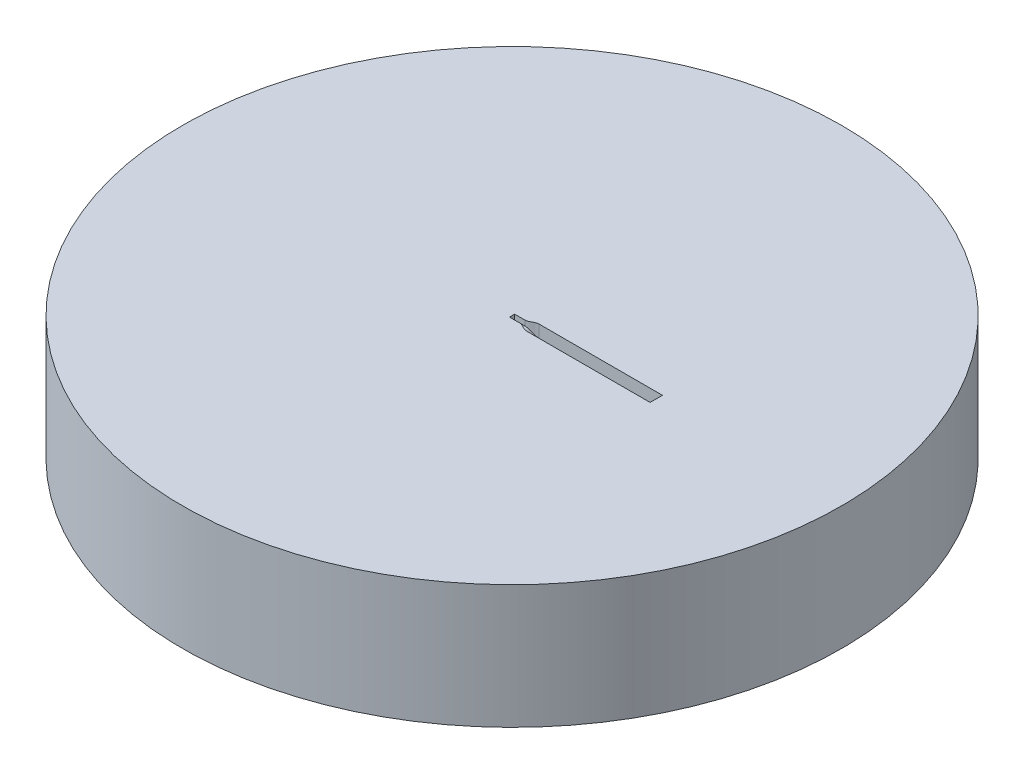
ISO-10303-21;
HEADER;
FILE_DESCRIPTION(('STEP AP214'),'2;1');
FILE_NAME('part.step','',(''),(''),'','','');
FILE_SCHEMA(('AUTOMOTIVE_DESIGN { 1 0 10303 214 1 1 1 1 }'));
ENDSEC;
DATA;
#1=APPLICATION_CONTEXT('core data for automotive mechanical design processes');
#2=APPLICATION_PROTOCOL_DEFINITION('international standard','automotive_design',2000,#1);
#3=PRODUCT_CONTEXT('',#1,'mechanical');
#4=PRODUCT('Part','Part','',(#3));
#5=PRODUCT_RELATED_PRODUCT_CATEGORY('part','',(#4));
#6=PRODUCT_DEFINITION_FORMATION('','',#4);
#7=PRODUCT_DEFINITION_CONTEXT('part definition',#1,'design');
#8=PRODUCT_DEFINITION('design','',#6,#7);
#9=PRODUCT_DEFINITION_SHAPE('','',#8);
#10=(LENGTH_UNIT() NAMED_UNIT(*) SI_UNIT(.MILLI.,.METRE.));
#11=(NAMED_UNIT(*) PLANE_ANGLE_UNIT() SI_UNIT($,.RADIAN.));
#12=(NAMED_UNIT(*) SI_UNIT($,.STERADIAN.) SOLID_ANGLE_UNIT());
#13=UNCERTAINTY_MEASURE_WITH_UNIT(LENGTH_MEASURE(1.E-05),#10,'distance_accuracy_value','');
#14=(GEOMETRIC_REPRESENTATION_CONTEXT(3) GLOBAL_UNCERTAINTY_ASSIGNED_CONTEXT((#13)) GLOBAL_UNIT_ASSIGNED_CONTEXT((#10,
#11,#12)) REPRESENTATION_CONTEXT('',''));
#15=CARTESIAN_POINT('',(0.,0.,0.));
#16=DIRECTION('',(0.,0.,1.));
#17=DIRECTION('',(1.,0.,0.));
#18=AXIS2_PLACEMENT_3D('',#15,#16,#17);
#19=CARTESIAN_POINT('',(0.,0.,0.));
#20=DIRECTION('',(0.,-1.,0.));
#21=DIRECTION('',(0.,0.,-1.));
#22=AXIS2_PLACEMENT_3D('',#19,#20,#21);
#23=PLANE('',#22);
#24=CARTESIAN_POINT('',(0.,0.,0.));
#25=DIRECTION('',(0.,-1.,0.));
#26=DIRECTION('',(0.,0.,-1.));
#27=AXIS2_PLACEMENT_3D('',#24,#25,#26);
#28=CIRCLE('',#27,8.);
#29=CARTESIAN_POINT('',(0.,0.,-8.));
#30=VERTEX_POINT('',#29);
#31=EDGE_CURVE('E85',#30,#30,#28,.T.);
#32=ORIENTED_EDGE('',*,*,#31,.F.);
#33=EDGE_LOOP('',(#32));
#34=FACE_BOUND('',#33,.T.);
#35=DIRECTION('',(-1.,0.,0.));
#36=VECTOR('',#35,1.);
#37=CARTESIAN_POINT('',(3.5,0.,0.15));
#38=LINE('',#37,#36);
#39=CARTESIAN_POINT('',(3.5,0.,0.15));
#40=VERTEX_POINT('',#39);
#41=CARTESIAN_POINT('',(0.5,0.,0.15));
#42=VERTEX_POINT('',#41);
#43=EDGE_CURVE('E162',#40,#42,#38,.T.);
#44=ORIENTED_EDGE('',*,*,#43,.T.);
#45=CARTESIAN_POINT('',(0.25,0.,0.0624999999999966));
#46=CARTESIAN_POINT('',(0.338290083751738,0.,0.0624999999999966));
#47=CARTESIAN_POINT('',(0.411709916248262,0.,0.15));
#48=CARTESIAN_POINT('',(0.5,0.,0.15));
#49=B_SPLINE_CURVE_WITH_KNOTS('',3,(#45,#46,#47,#48),.UNSPECIFIED.,.F.,.F.,(4,4),(0.,1.),.UNSPECIFIED.);
#50=CARTESIAN_POINT('',(0.25,0.,0.0624999999999966));
#51=VERTEX_POINT('',#50);
#52=EDGE_CURVE('E299',#42,#51,#49,.F.);
#53=ORIENTED_EDGE('',*,*,#52,.T.);
#54=DIRECTION('',(-1.,0.,0.));
#55=VECTOR('',#54,1.);
#56=CARTESIAN_POINT('',(0.25,0.,0.0624999999999966));
#57=LINE('',#56,#55);
#58=CARTESIAN_POINT('',(0.,0.,0.0624999999999966));
#59=VERTEX_POINT('',#58);
#60=EDGE_CURVE('E291',#51,#59,#57,.T.);
#61=ORIENTED_EDGE('',*,*,#60,.T.);
#62=DIRECTION('',(0.,0.,1.));
#63=VECTOR('',#62,1.);
#64=CARTESIAN_POINT('',(0.,0.,0.0624999999999966));
#65=LINE('',#64,#63);
#66=CARTESIAN_POINT('',(0.,0.,-0.0625000000000001));
#67=VERTEX_POINT('',#66);
#68=EDGE_CURVE('E289',#67,#59,#65,.T.);
#69=ORIENTED_EDGE('',*,*,#68,.F.);
#70=DIRECTION('',(-1.,0.,0.));
#71=VECTOR('',#70,1.);
#72=CARTESIAN_POINT('',(0.25,0.,-0.0625000000000001));
#73=LINE('',#72,#71);
#74=CARTESIAN_POINT('',(0.25,0.,-0.0625000000000001));
#75=VERTEX_POINT('',#74);
#76=EDGE_CURVE('E195',#75,#67,#73,.T.);
#77=ORIENTED_EDGE('',*,*,#76,.F.);
#78=CARTESIAN_POINT('',(0.25,0.,-0.0625000000000035));
#79=CARTESIAN_POINT('',(0.338290083751738,0.,-0.0625000000000035));
#80=CARTESIAN_POINT('',(0.411709916248263,0.,-0.15));
#81=CARTESIAN_POINT('',(0.5,0.,-0.15));
#82=B_SPLINE_CURVE_WITH_KNOTS('',3,(#78,#79,#80,#81),.UNSPECIFIED.,.F.,.F.,(4,4),(0.,1.),.UNSPECIFIED.);
#83=CARTESIAN_POINT('',(0.5,0.,-0.15));
#84=VERTEX_POINT('',#83);
#85=EDGE_CURVE('E250',#75,#84,#82,.T.);
#86=ORIENTED_EDGE('',*,*,#85,.T.);
#87=DIRECTION('',(-1.,0.,0.));
#88=VECTOR('',#87,1.);
#89=CARTESIAN_POINT('',(3.5,0.,-0.15));
#90=LINE('',#89,#88);
#91=CARTESIAN_POINT('',(3.5,0.,-0.15));
#92=VERTEX_POINT('',#91);
#93=EDGE_CURVE('E93',#92,#84,#90,.T.);
#94=ORIENTED_EDGE('',*,*,#93,.F.);
#95=DIRECTION('',(0.,0.,1.));
#96=VECTOR('',#95,1.);
#97=CARTESIAN_POINT('',(3.5,0.,0.15));
#98=LINE('',#97,#96);
#99=EDGE_CURVE('E278',#92,#40,#98,.T.);
#100=ORIENTED_EDGE('',*,*,#99,.T.);
#101=EDGE_LOOP('',(#44,#53,#61,#69,#77,#86,#94,#100));
#102=FACE_BOUND('',#101,.T.);
#103=ADVANCED_FACE('F75',(#34,#102),#23,.F.);
#104=CARTESIAN_POINT('',(0.,-3.,0.));
#105=DIRECTION('',(0.,1.,0.));
#106=DIRECTION('',(0.,0.,1.));
#107=AXIS2_PLACEMENT_3D('',#104,#105,#106);
#108=CYLINDRICAL_SURFACE('',#107,8.);
#109=CARTESIAN_POINT('',(0.,-3.,0.));
#110=DIRECTION('',(0.,-1.,0.));
#111=DIRECTION('',(0.,0.,-1.));
#112=AXIS2_PLACEMENT_3D('',#109,#110,#111);
#113=CIRCLE('',#112,8.);
#114=CARTESIAN_POINT('',(0.,-3.,-8.));
#115=VERTEX_POINT('',#114);
#116=EDGE_CURVE('E12',#115,#115,#113,.T.);
#117=ORIENTED_EDGE('',*,*,#116,.F.);
#118=EDGE_LOOP('',(#117));
#119=FACE_BOUND('',#118,.T.);
#120=ORIENTED_EDGE('',*,*,#31,.T.);
#121=EDGE_LOOP('',(#120));
#122=FACE_BOUND('',#121,.T.);
#123=ADVANCED_FACE('F77',(#119,#122),#108,.T.);
#124=CARTESIAN_POINT('',(0.,-3.,0.));
#125=DIRECTION('',(0.,-1.,0.));
#126=DIRECTION('',(0.,0.,-1.));
#127=AXIS2_PLACEMENT_3D('',#124,#125,#126);
#128=PLANE('',#127);
#129=ORIENTED_EDGE('',*,*,#116,.T.);
#130=EDGE_LOOP('',(#129));
#131=FACE_BOUND('',#130,.T.);
#132=ADVANCED_FACE('F332',(#131),#128,.T.);
#133=CARTESIAN_POINT('',(0.25,0.,0.0624999999999966));
#134=CARTESIAN_POINT('',(0.338290083751738,0.,0.0624999999999966));
#135=CARTESIAN_POINT('',(0.411709916248262,0.,0.15));
#136=CARTESIAN_POINT('',(0.5,0.,0.15));
#137=CARTESIAN_POINT('',(0.25,-0.0416666666666667,0.0624999999999966));
#138=CARTESIAN_POINT('',(0.344133458887826,-0.0416666666666667,0.0624999999999966));
#139=CARTESIAN_POINT('',(0.405866541112174,-0.1,0.15));
#140=CARTESIAN_POINT('',(0.5,-0.1,0.15));
#141=CARTESIAN_POINT('',(0.25,-0.0833333333333334,0.0624999999999966));
#142=CARTESIAN_POINT('',(0.349976834023915,-0.0833333333333334,0.0624999999999966));
#143=CARTESIAN_POINT('',(0.400023165976085,-0.2,0.15));
#144=CARTESIAN_POINT('',(0.5,-0.2,0.15));
#145=CARTESIAN_POINT('',(0.25,-0.125,0.0624999999999966));
#146=CARTESIAN_POINT('',(0.355820209160003,-0.125,0.0624999999999966));
#147=CARTESIAN_POINT('',(0.394179790839997,-0.3,0.15));
#148=CARTESIAN_POINT('',(0.5,-0.3,0.15));
#149=B_SPLINE_SURFACE_WITH_KNOTS('',3,3,((#133,#134,#135,#136),(#137,#138,#139,#140),(#141,#142,
#143,#144),(#145,#146,#147,#148)),.UNSPECIFIED.,.F.,.F.,.F.,(4,4),(4,4),(0.,1.),(0.,1.),.UNSPECIFIED.);
#150=DIRECTION('',(0.,-1.,0.));
#151=VECTOR('',#150,1.);
#152=CARTESIAN_POINT('',(0.25,0.,0.0624999999999966));
#153=LINE('',#152,#151);
#154=CARTESIAN_POINT('',(0.25,-0.125,0.0624999999999966));
#155=VERTEX_POINT('',#154);
#156=EDGE_CURVE('E241',#51,#155,#153,.T.);
#157=DIRECTION('',(0.,-1.,0.));
#158=VECTOR('',#157,1.);
#159=CARTESIAN_POINT('',(0.5,0.,0.15));
#160=LINE('',#159,#158);
#161=CARTESIAN_POINT('',(0.5,-0.3,0.15));
#162=VERTEX_POINT('',#161);
#163=EDGE_CURVE('E79',#42,#162,#160,.T.);
#164=CARTESIAN_POINT('',(0.25,-0.125,0.0624999999999966));
#165=CARTESIAN_POINT('',(0.355820209160003,-0.125,0.0624999999999966));
#166=CARTESIAN_POINT('',(0.394179790839997,-0.3,0.15));
#167=CARTESIAN_POINT('',(0.5,-0.3,0.15));
#168=B_SPLINE_CURVE_WITH_KNOTS('',3,(#164,#165,#166,#167),.UNSPECIFIED.,.F.,.F.,(4,4),(0.,1.),.UNSPECIFIED.);
#169=EDGE_CURVE('E304',#155,#162,#168,.T.);
#170=ORIENTED_EDGE('',*,*,#156,.F.);
#171=ORIENTED_EDGE('',*,*,#52,.F.);
#172=ORIENTED_EDGE('',*,*,#163,.T.);
#173=ORIENTED_EDGE('',*,*,#169,.F.);
#174=EDGE_LOOP('',(#170,#171,#172,#173));
#175=FACE_BOUND('',#174,.T.);
#176=ADVANCED_FACE('F320',(#175),#149,.F.);
#177=CARTESIAN_POINT('',(0.25,-0.125,0.0624999999999966));
#178=CARTESIAN_POINT('',(0.355820209160003,-0.125,0.0624999999999966));
#179=CARTESIAN_POINT('',(0.394179790839997,-0.3,0.15));
#180=CARTESIAN_POINT('',(0.5,-0.3,0.15));
#181=CARTESIAN_POINT('',(0.25,-0.125,0.0208333333333311));
#182=CARTESIAN_POINT('',(0.355820209160003,-0.125,0.0208333333333311));
#183=CARTESIAN_POINT('',(0.394179790839997,-0.3,0.05));
#184=CARTESIAN_POINT('',(0.5,-0.3,0.05));
#185=CARTESIAN_POINT('',(0.25,-0.125,-0.0208333333333345));
#186=CARTESIAN_POINT('',(0.355820209160003,-0.125,-0.0208333333333345));
#187=CARTESIAN_POINT('',(0.394179790839998,-0.3,-0.05));
#188=CARTESIAN_POINT('',(0.5,-0.3,-0.05));
#189=CARTESIAN_POINT('',(0.25,-0.125,-0.0625));
#190=CARTESIAN_POINT('',(0.355820209160002,-0.125,-0.0625));
#191=CARTESIAN_POINT('',(0.394179790839998,-0.3,-0.15));
#192=CARTESIAN_POINT('',(0.5,-0.3,-0.15));
#193=B_SPLINE_SURFACE_WITH_KNOTS('',3,3,((#177,#178,#179,#180),(#181,#182,#183,#184),(#185,#186,
#187,#188),(#189,#190,#191,#192)),.UNSPECIFIED.,.F.,.F.,.F.,(4,4),(4,4),(0.,1.),(0.,1.),.UNSPECIFIED.);
#194=DIRECTION('',(0.,0.,-1.));
#195=VECTOR('',#194,1.);
#196=CARTESIAN_POINT('',(0.25,-0.125,0.0624999999999966));
#197=LINE('',#196,#195);
#198=CARTESIAN_POINT('',(0.25,-0.125,-0.0625000000000001));
#199=VERTEX_POINT('',#198);
#200=EDGE_CURVE('E233',#155,#199,#197,.T.);
#201=DIRECTION('',(0.,0.,-1.));
#202=VECTOR('',#201,1.);
#203=CARTESIAN_POINT('',(0.5,-0.3,0.15));
#204=LINE('',#203,#202);
#205=CARTESIAN_POINT('',(0.5,-0.3,-0.15));
#206=VERTEX_POINT('',#205);
#207=EDGE_CURVE('E166',#162,#206,#204,.T.);
#208=CARTESIAN_POINT('',(0.25,-0.125,-0.0625));
#209=CARTESIAN_POINT('',(0.355820209160002,-0.125,-0.0625));
#210=CARTESIAN_POINT('',(0.394179790839998,-0.3,-0.15));
#211=CARTESIAN_POINT('',(0.5,-0.3,-0.15));
#212=B_SPLINE_CURVE_WITH_KNOTS('',3,(#208,#209,#210,#211),.UNSPECIFIED.,.F.,.F.,(4,4),(0.,1.),.UNSPECIFIED.);
#213=EDGE_CURVE('E294',#199,#206,#212,.T.);
#214=ORIENTED_EDGE('',*,*,#200,.F.);
#215=ORIENTED_EDGE('',*,*,#169,.T.);
#216=ORIENTED_EDGE('',*,*,#207,.T.);
#217=ORIENTED_EDGE('',*,*,#213,.F.);
#218=EDGE_LOOP('',(#214,#215,#216,#217));
#219=FACE_BOUND('',#218,.T.);
#220=ADVANCED_FACE('F331',(#219),#193,.F.);
#221=CARTESIAN_POINT('',(0.25,-0.125,-0.0625000000000001));
#222=CARTESIAN_POINT('',(0.355820209160002,-0.125,-0.0625000000000001));
#223=CARTESIAN_POINT('',(0.394179790839998,-0.3,-0.15));
#224=CARTESIAN_POINT('',(0.5,-0.3,-0.15));
#225=CARTESIAN_POINT('',(0.25,-0.0833333333333334,-0.0625000000000012));
#226=CARTESIAN_POINT('',(0.349976834023914,-0.0833333333333334,-0.0625000000000012));
#227=CARTESIAN_POINT('',(0.400023165976086,-0.2,-0.15));
#228=CARTESIAN_POINT('',(0.5,-0.2,-0.15));
#229=CARTESIAN_POINT('',(0.25,-0.0416666666666667,-0.0625000000000024));
#230=CARTESIAN_POINT('',(0.344133458887826,-0.0416666666666667,-0.0625000000000024));
#231=CARTESIAN_POINT('',(0.405866541112174,-0.1,-0.15));
#232=CARTESIAN_POINT('',(0.5,-0.1,-0.15));
#233=CARTESIAN_POINT('',(0.25,0.,-0.0625000000000035));
#234=CARTESIAN_POINT('',(0.338290083751738,0.,-0.0625000000000035));
#235=CARTESIAN_POINT('',(0.411709916248263,0.,-0.15));
#236=CARTESIAN_POINT('',(0.5,0.,-0.15));
#237=B_SPLINE_SURFACE_WITH_KNOTS('',3,3,((#221,#222,#223,#224),(#225,#226,#227,#228),(#229,#230,
#231,#232),(#233,#234,#235,#236)),.UNSPECIFIED.,.F.,.F.,.F.,(4,4),(4,4),(0.,1.),(0.,1.),.UNSPECIFIED.);
#238=DIRECTION('',(0.,1.,0.));
#239=VECTOR('',#238,1.);
#240=CARTESIAN_POINT('',(0.25,0.,-0.0625000000000035));
#241=LINE('',#240,#239);
#242=EDGE_CURVE('E192',#199,#75,#241,.T.);
#243=DIRECTION('',(0.,1.,0.));
#244=VECTOR('',#243,1.);
#245=CARTESIAN_POINT('',(0.5,0.,-0.15));
#246=LINE('',#245,#244);
#247=EDGE_CURVE('E184',#206,#84,#246,.T.);
#248=ORIENTED_EDGE('',*,*,#242,.F.);
#249=ORIENTED_EDGE('',*,*,#213,.T.);
#250=ORIENTED_EDGE('',*,*,#247,.T.);
#251=ORIENTED_EDGE('',*,*,#85,.F.);
#252=EDGE_LOOP('',(#248,#249,#250,#251));
#253=FACE_BOUND('',#252,.T.);
#254=ADVANCED_FACE('F373',(#253),#237,.F.);
#255=CARTESIAN_POINT('',(0.25,0.,0.0624999999999966));
#256=DIRECTION('',(0.,0.,-1.));
#257=DIRECTION('',(0.,1.,0.));
#258=AXIS2_PLACEMENT_3D('',#255,#256,#257);
#259=PLANE('',#258);
#260=DIRECTION('',(0.,-1.,0.));
#261=VECTOR('',#260,1.);
#262=CARTESIAN_POINT('',(0.,0.,0.0624999999999966));
#263=LINE('',#262,#261);
#264=CARTESIAN_POINT('',(0.,-0.125,0.0624999999999966));
#265=VERTEX_POINT('',#264);
#266=EDGE_CURVE('E168',#59,#265,#263,.T.);
#267=ORIENTED_EDGE('',*,*,#266,.F.);
#268=ORIENTED_EDGE('',*,*,#60,.F.);
#269=ORIENTED_EDGE('',*,*,#156,.T.);
#270=DIRECTION('',(-1.,0.,0.));
#271=VECTOR('',#270,1.);
#272=CARTESIAN_POINT('',(0.25,-0.125,0.0624999999999966));
#273=LINE('',#272,#271);
#274=EDGE_CURVE('E194',#155,#265,#273,.T.);
#275=ORIENTED_EDGE('',*,*,#274,.T.);
#276=EDGE_LOOP('',(#267,#268,#269,#275));
#277=FACE_BOUND('',#276,.T.);
#278=ADVANCED_FACE('F223',(#277),#259,.T.);
#279=CARTESIAN_POINT('',(0.25,-0.125,0.0624999999999966));
#280=DIRECTION('',(0.,1.,0.));
#281=DIRECTION('',(0.,0.,1.));
#282=AXIS2_PLACEMENT_3D('',#279,#280,#281);
#283=PLANE('',#282);
#284=DIRECTION('',(0.,0.,-1.));
#285=VECTOR('',#284,1.);
#286=CARTESIAN_POINT('',(0.,-0.125,0.0624999999999966));
#287=LINE('',#286,#285);
#288=CARTESIAN_POINT('',(0.,-0.125,-0.0625000000000001));
#289=VERTEX_POINT('',#288);
#290=EDGE_CURVE('E172',#265,#289,#287,.T.);
#291=ORIENTED_EDGE('',*,*,#290,.F.);
#292=ORIENTED_EDGE('',*,*,#274,.F.);
#293=ORIENTED_EDGE('',*,*,#200,.T.);
#294=DIRECTION('',(-1.,0.,0.));
#295=VECTOR('',#294,1.);
#296=CARTESIAN_POINT('',(0.25,-0.125,-0.0625000000000001));
#297=LINE('',#296,#295);
#298=EDGE_CURVE('E101',#199,#289,#297,.T.);
#299=ORIENTED_EDGE('',*,*,#298,.T.);
#300=EDGE_LOOP('',(#291,#292,#293,#299));
#301=FACE_BOUND('',#300,.T.);
#302=ADVANCED_FACE('F218',(#301),#283,.T.);
#303=CARTESIAN_POINT('',(0.25,0.,-0.0625000000000001));
#304=DIRECTION('',(0.,0.,1.));
#305=DIRECTION('',(1.,0.,0.));
#306=AXIS2_PLACEMENT_3D('',#303,#304,#305);
#307=PLANE('',#306);
#308=DIRECTION('',(0.,1.,0.));
#309=VECTOR('',#308,1.);
#310=CARTESIAN_POINT('',(0.,0.,-0.0625000000000001));
#311=LINE('',#310,#309);
#312=EDGE_CURVE('E287',#289,#67,#311,.T.);
#313=ORIENTED_EDGE('',*,*,#312,.F.);
#314=ORIENTED_EDGE('',*,*,#298,.F.);
#315=ORIENTED_EDGE('',*,*,#242,.T.);
#316=ORIENTED_EDGE('',*,*,#76,.T.);
#317=EDGE_LOOP('',(#313,#314,#315,#316));
#318=FACE_BOUND('',#317,.T.);
#319=ADVANCED_FACE('F207',(#318),#307,.T.);
#320=CARTESIAN_POINT('',(0.,-0.125,0.0624999999999966));
#321=DIRECTION('',(1.,0.,0.));
#322=DIRECTION('',(0.,0.,-1.));
#323=AXIS2_PLACEMENT_3D('',#320,#321,#322);
#324=PLANE('',#323);
#325=ORIENTED_EDGE('',*,*,#266,.T.);
#326=ORIENTED_EDGE('',*,*,#290,.T.);
#327=ORIENTED_EDGE('',*,*,#312,.T.);
#328=ORIENTED_EDGE('',*,*,#68,.T.);
#329=EDGE_LOOP('',(#325,#326,#327,#328));
#330=FACE_BOUND('',#329,.T.);
#331=ADVANCED_FACE('F217',(#330),#324,.T.);
#332=CARTESIAN_POINT('',(3.5,0.,0.15));
#333=DIRECTION('',(0.,0.,-1.));
#334=DIRECTION('',(0.,1.,0.));
#335=AXIS2_PLACEMENT_3D('',#332,#333,#334);
#336=PLANE('',#335);
#337=ORIENTED_EDGE('',*,*,#163,.F.);
#338=ORIENTED_EDGE('',*,*,#43,.F.);
#339=DIRECTION('',(0.,-1.,0.));
#340=VECTOR('',#339,1.);
#341=CARTESIAN_POINT('',(3.5,0.,0.15));
#342=LINE('',#341,#340);
#343=CARTESIAN_POINT('',(3.5,-0.3,0.15));
#344=VERTEX_POINT('',#343);
#345=EDGE_CURVE('E149',#40,#344,#342,.T.);
#346=ORIENTED_EDGE('',*,*,#345,.T.);
#347=DIRECTION('',(-1.,0.,0.));
#348=VECTOR('',#347,1.);
#349=CARTESIAN_POINT('',(3.5,-0.3,0.15));
#350=LINE('',#349,#348);
#351=EDGE_CURVE('E159',#344,#162,#350,.T.);
#352=ORIENTED_EDGE('',*,*,#351,.T.);
#353=EDGE_LOOP('',(#337,#338,#346,#352));
#354=FACE_BOUND('',#353,.T.);
#355=ADVANCED_FACE('F158',(#354),#336,.T.);
#356=CARTESIAN_POINT('',(3.5,-0.3,0.15));
#357=DIRECTION('',(0.,1.,0.));
#358=DIRECTION('',(0.,0.,1.));
#359=AXIS2_PLACEMENT_3D('',#356,#357,#358);
#360=PLANE('',#359);
#361=ORIENTED_EDGE('',*,*,#207,.F.);
#362=ORIENTED_EDGE('',*,*,#351,.F.);
#363=DIRECTION('',(0.,0.,-1.));
#364=VECTOR('',#363,1.);
#365=CARTESIAN_POINT('',(3.5,-0.3,0.15));
#366=LINE('',#365,#364);
#367=CARTESIAN_POINT('',(3.5,-0.3,-0.15));
#368=VERTEX_POINT('',#367);
#369=EDGE_CURVE('E145',#344,#368,#366,.T.);
#370=ORIENTED_EDGE('',*,*,#369,.T.);
#371=DIRECTION('',(-1.,0.,0.));
#372=VECTOR('',#371,1.);
#373=CARTESIAN_POINT('',(3.5,-0.3,-0.15));
#374=LINE('',#373,#372);
#375=EDGE_CURVE('E169',#368,#206,#374,.T.);
#376=ORIENTED_EDGE('',*,*,#375,.T.);
#377=EDGE_LOOP('',(#361,#362,#370,#376));
#378=FACE_BOUND('',#377,.T.);
#379=ADVANCED_FACE('F164',(#378),#360,.T.);
#380=CARTESIAN_POINT('',(3.5,0.,-0.15));
#381=DIRECTION('',(0.,0.,1.));
#382=DIRECTION('',(0.,-1.,0.));
#383=AXIS2_PLACEMENT_3D('',#380,#381,#382);
#384=PLANE('',#383);
#385=ORIENTED_EDGE('',*,*,#247,.F.);
#386=ORIENTED_EDGE('',*,*,#375,.F.);
#387=DIRECTION('',(0.,1.,0.));
#388=VECTOR('',#387,1.);
#389=CARTESIAN_POINT('',(3.5,0.,-0.15));
#390=LINE('',#389,#388);
#391=EDGE_CURVE('E151',#368,#92,#390,.T.);
#392=ORIENTED_EDGE('',*,*,#391,.T.);
#393=ORIENTED_EDGE('',*,*,#93,.T.);
#394=EDGE_LOOP('',(#385,#386,#392,#393));
#395=FACE_BOUND('',#394,.T.);
#396=ADVANCED_FACE('F257',(#395),#384,.T.);
#397=CARTESIAN_POINT('',(3.5,-0.3,0.15));
#398=DIRECTION('',(1.,0.,0.));
#399=DIRECTION('',(0.,0.,-1.));
#400=AXIS2_PLACEMENT_3D('',#397,#398,#399);
#401=PLANE('',#400);
#402=ORIENTED_EDGE('',*,*,#345,.F.);
#403=ORIENTED_EDGE('',*,*,#99,.F.);
#404=ORIENTED_EDGE('',*,*,#391,.F.);
#405=ORIENTED_EDGE('',*,*,#369,.F.);
#406=EDGE_LOOP('',(#402,#403,#404,#405));
#407=FACE_BOUND('',#406,.T.);
#408=ADVANCED_FACE('F147',(#407),#401,.F.);
#409=CLOSED_SHELL('',(#103,#123,#132,#176,#220,#254,#278,#302,#319,#331,#355,#379,#396,#408));
#410=MANIFOLD_SOLID_BREP('B2',#409);
#411=ADVANCED_BREP_SHAPE_REPRESENTATION('',(#18,#410),#14);
#412=SHAPE_DEFINITION_REPRESENTATION(#9,#411);
ENDSEC;
END-ISO-10303-21;
